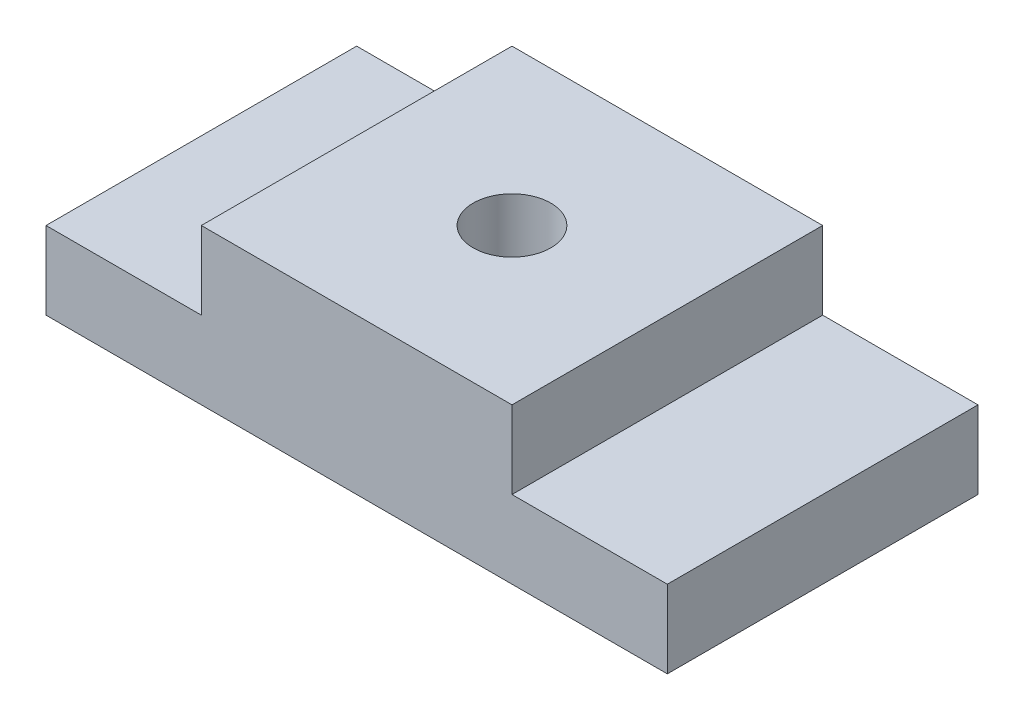
ISO-10303-21;
HEADER;
FILE_DESCRIPTION(('STEP AP214'),'2;1');
FILE_NAME('part.step','',(''),(''),'','','');
FILE_SCHEMA(('AUTOMOTIVE_DESIGN { 1 0 10303 214 1 1 1 1 }'));
ENDSEC;
DATA;
#1=APPLICATION_CONTEXT('core data for automotive mechanical design processes');
#2=APPLICATION_PROTOCOL_DEFINITION('international standard','automotive_design',2000,#1);
#3=PRODUCT_CONTEXT('',#1,'mechanical');
#4=PRODUCT('Part','Part','',(#3));
#5=PRODUCT_RELATED_PRODUCT_CATEGORY('part','',(#4));
#6=PRODUCT_DEFINITION_FORMATION('','',#4);
#7=PRODUCT_DEFINITION_CONTEXT('part definition',#1,'design');
#8=PRODUCT_DEFINITION('design','',#6,#7);
#9=PRODUCT_DEFINITION_SHAPE('','',#8);
#10=(LENGTH_UNIT() NAMED_UNIT(*) SI_UNIT(.MILLI.,.METRE.));
#11=(NAMED_UNIT(*) PLANE_ANGLE_UNIT() SI_UNIT($,.RADIAN.));
#12=(NAMED_UNIT(*) SI_UNIT($,.STERADIAN.) SOLID_ANGLE_UNIT());
#13=UNCERTAINTY_MEASURE_WITH_UNIT(LENGTH_MEASURE(1.E-05),#10,'distance_accuracy_value','');
#14=(GEOMETRIC_REPRESENTATION_CONTEXT(3) GLOBAL_UNCERTAINTY_ASSIGNED_CONTEXT((#13)) GLOBAL_UNIT_ASSIGNED_CONTEXT((#10,
#11,#12)) REPRESENTATION_CONTEXT('',''));
#15=CARTESIAN_POINT('',(0.,0.,0.));
#16=DIRECTION('',(0.,0.,1.));
#17=DIRECTION('',(1.,0.,0.));
#18=AXIS2_PLACEMENT_3D('',#15,#16,#17);
#19=CARTESIAN_POINT('',(0.,10.,0.));
#20=DIRECTION('',(0.,-1.,0.));
#21=DIRECTION('',(0.,0.,-1.));
#22=AXIS2_PLACEMENT_3D('',#19,#20,#21);
#23=PLANE('',#22);
#24=DIRECTION('',(0.,0.,-1.));
#25=VECTOR('',#24,1.);
#26=CARTESIAN_POINT('',(20.,10.,20.));
#27=LINE('',#26,#25);
#28=CARTESIAN_POINT('',(20.,10.,20.));
#29=VERTEX_POINT('',#28);
#30=CARTESIAN_POINT('',(20.,10.,-20.));
#31=VERTEX_POINT('',#30);
#32=EDGE_CURVE('E54',#29,#31,#27,.T.);
#33=ORIENTED_EDGE('',*,*,#32,.F.);
#34=DIRECTION('',(1.,0.,0.));
#35=VECTOR('',#34,1.);
#36=CARTESIAN_POINT('',(-40.,10.,20.));
#37=LINE('',#36,#35);
#38=CARTESIAN_POINT('',(40.,10.,20.));
#39=VERTEX_POINT('',#38);
#40=EDGE_CURVE('E151',#29,#39,#37,.T.);
#41=ORIENTED_EDGE('',*,*,#40,.T.);
#42=DIRECTION('',(0.,0.,-1.));
#43=VECTOR('',#42,1.);
#44=CARTESIAN_POINT('',(40.,10.,20.));
#45=LINE('',#44,#43);
#46=CARTESIAN_POINT('',(40.,10.,-20.));
#47=VERTEX_POINT('',#46);
#48=EDGE_CURVE('E139',#39,#47,#45,.T.);
#49=ORIENTED_EDGE('',*,*,#48,.T.);
#50=DIRECTION('',(-1.,0.,0.));
#51=VECTOR('',#50,1.);
#52=CARTESIAN_POINT('',(-40.,10.,-20.));
#53=LINE('',#52,#51);
#54=EDGE_CURVE('E145',#47,#31,#53,.T.);
#55=ORIENTED_EDGE('',*,*,#54,.T.);
#56=EDGE_LOOP('',(#33,#41,#49,#55));
#57=FACE_BOUND('',#56,.T.);
#58=ADVANCED_FACE('F38',(#57),#23,.F.);
#59=DIRECTION('',(0.,0.,1.));
#60=VECTOR('',#59,1.);
#61=CARTESIAN_POINT('',(-20.,10.,20.));
#62=LINE('',#61,#60);
#63=CARTESIAN_POINT('',(-20.,10.,-20.));
#64=VERTEX_POINT('',#63);
#65=CARTESIAN_POINT('',(-20.,10.,20.));
#66=VERTEX_POINT('',#65);
#67=EDGE_CURVE('E62',#64,#66,#62,.T.);
#68=ORIENTED_EDGE('',*,*,#67,.F.);
#69=CARTESIAN_POINT('',(-40.,10.,-20.));
#70=VERTEX_POINT('',#69);
#71=EDGE_CURVE('E143',#64,#70,#53,.T.);
#72=ORIENTED_EDGE('',*,*,#71,.T.);
#73=DIRECTION('',(0.,0.,1.));
#74=VECTOR('',#73,1.);
#75=CARTESIAN_POINT('',(-40.,10.,20.));
#76=LINE('',#75,#74);
#77=CARTESIAN_POINT('',(-40.,10.,20.));
#78=VERTEX_POINT('',#77);
#79=EDGE_CURVE('E148',#70,#78,#76,.T.);
#80=ORIENTED_EDGE('',*,*,#79,.T.);
#81=EDGE_CURVE('E152',#78,#66,#37,.T.);
#82=ORIENTED_EDGE('',*,*,#81,.T.);
#83=EDGE_LOOP('',(#68,#72,#80,#82));
#84=FACE_BOUND('',#83,.T.);
#85=ADVANCED_FACE('F190',(#84),#23,.F.);
#86=CARTESIAN_POINT('',(40.,10.,20.));
#87=DIRECTION('',(-1.,0.,0.));
#88=DIRECTION('',(0.,0.,1.));
#89=AXIS2_PLACEMENT_3D('',#86,#87,#88);
#90=PLANE('',#89);
#91=DIRECTION('',(0.,0.,-1.));
#92=VECTOR('',#91,1.);
#93=CARTESIAN_POINT('',(40.,0.,20.));
#94=LINE('',#93,#92);
#95=CARTESIAN_POINT('',(40.,0.,20.));
#96=VERTEX_POINT('',#95);
#97=CARTESIAN_POINT('',(40.,0.,-20.));
#98=VERTEX_POINT('',#97);
#99=EDGE_CURVE('E128',#96,#98,#94,.T.);
#100=ORIENTED_EDGE('',*,*,#99,.T.);
#101=DIRECTION('',(0.,-1.,0.));
#102=VECTOR('',#101,1.);
#103=CARTESIAN_POINT('',(40.,10.,-20.));
#104=LINE('',#103,#102);
#105=EDGE_CURVE('E11',#47,#98,#104,.T.);
#106=ORIENTED_EDGE('',*,*,#105,.F.);
#107=ORIENTED_EDGE('',*,*,#48,.F.);
#108=DIRECTION('',(0.,-1.,0.));
#109=VECTOR('',#108,1.);
#110=CARTESIAN_POINT('',(40.,10.,20.));
#111=LINE('',#110,#109);
#112=EDGE_CURVE('E154',#39,#96,#111,.T.);
#113=ORIENTED_EDGE('',*,*,#112,.T.);
#114=EDGE_LOOP('',(#100,#106,#107,#113));
#115=FACE_BOUND('',#114,.T.);
#116=ADVANCED_FACE('F40',(#115),#90,.F.);
#117=CARTESIAN_POINT('',(-40.,10.,-20.));
#118=DIRECTION('',(0.,0.,1.));
#119=DIRECTION('',(1.,0.,0.));
#120=AXIS2_PLACEMENT_3D('',#117,#118,#119);
#121=PLANE('',#120);
#122=DIRECTION('',(-1.,0.,0.));
#123=VECTOR('',#122,1.);
#124=CARTESIAN_POINT('',(-40.,0.,-20.));
#125=LINE('',#124,#123);
#126=CARTESIAN_POINT('',(-40.,0.,-20.));
#127=VERTEX_POINT('',#126);
#128=EDGE_CURVE('E133',#98,#127,#125,.T.);
#129=ORIENTED_EDGE('',*,*,#128,.T.);
#130=DIRECTION('',(0.,-1.,0.));
#131=VECTOR('',#130,1.);
#132=CARTESIAN_POINT('',(-40.,10.,-20.));
#133=LINE('',#132,#131);
#134=EDGE_CURVE('E47',#70,#127,#133,.T.);
#135=ORIENTED_EDGE('',*,*,#134,.F.);
#136=ORIENTED_EDGE('',*,*,#71,.F.);
#137=DIRECTION('',(0.,-1.,0.));
#138=VECTOR('',#137,1.);
#139=CARTESIAN_POINT('',(-20.,20.,-20.));
#140=LINE('',#139,#138);
#141=CARTESIAN_POINT('',(-20.,20.,-20.));
#142=VERTEX_POINT('',#141);
#143=EDGE_CURVE('E110',#142,#64,#140,.T.);
#144=ORIENTED_EDGE('',*,*,#143,.F.);
#145=DIRECTION('',(-1.,0.,0.));
#146=VECTOR('',#145,1.);
#147=CARTESIAN_POINT('',(-20.,20.,-20.));
#148=LINE('',#147,#146);
#149=CARTESIAN_POINT('',(20.,20.,-20.));
#150=VERTEX_POINT('',#149);
#151=EDGE_CURVE('E104',#150,#142,#148,.T.);
#152=ORIENTED_EDGE('',*,*,#151,.F.);
#153=DIRECTION('',(0.,-1.,0.));
#154=VECTOR('',#153,1.);
#155=CARTESIAN_POINT('',(20.,20.,-20.));
#156=LINE('',#155,#154);
#157=EDGE_CURVE('E108',#150,#31,#156,.T.);
#158=ORIENTED_EDGE('',*,*,#157,.T.);
#159=ORIENTED_EDGE('',*,*,#54,.F.);
#160=ORIENTED_EDGE('',*,*,#105,.T.);
#161=EDGE_LOOP('',(#129,#135,#136,#144,#152,#158,#159,#160));
#162=FACE_BOUND('',#161,.T.);
#163=ADVANCED_FACE('F106',(#162),#121,.F.);
#164=CARTESIAN_POINT('',(-40.,10.,20.));
#165=DIRECTION('',(1.,0.,0.));
#166=DIRECTION('',(0.,0.,-1.));
#167=AXIS2_PLACEMENT_3D('',#164,#165,#166);
#168=PLANE('',#167);
#169=DIRECTION('',(0.,0.,1.));
#170=VECTOR('',#169,1.);
#171=CARTESIAN_POINT('',(-40.,0.,20.));
#172=LINE('',#171,#170);
#173=CARTESIAN_POINT('',(-40.,0.,20.));
#174=VERTEX_POINT('',#173);
#175=EDGE_CURVE('E158',#127,#174,#172,.T.);
#176=ORIENTED_EDGE('',*,*,#175,.T.);
#177=DIRECTION('',(0.,-1.,0.));
#178=VECTOR('',#177,1.);
#179=CARTESIAN_POINT('',(-40.,10.,20.));
#180=LINE('',#179,#178);
#181=EDGE_CURVE('E166',#78,#174,#180,.T.);
#182=ORIENTED_EDGE('',*,*,#181,.F.);
#183=ORIENTED_EDGE('',*,*,#79,.F.);
#184=ORIENTED_EDGE('',*,*,#134,.T.);
#185=EDGE_LOOP('',(#176,#182,#183,#184));
#186=FACE_BOUND('',#185,.T.);
#187=ADVANCED_FACE('F175',(#186),#168,.F.);
#188=CARTESIAN_POINT('',(-40.,10.,20.));
#189=DIRECTION('',(0.,0.,-1.));
#190=DIRECTION('',(-1.,0.,0.));
#191=AXIS2_PLACEMENT_3D('',#188,#189,#190);
#192=PLANE('',#191);
#193=DIRECTION('',(1.,0.,0.));
#194=VECTOR('',#193,1.);
#195=CARTESIAN_POINT('',(-40.,0.,20.));
#196=LINE('',#195,#194);
#197=EDGE_CURVE('E144',#174,#96,#196,.T.);
#198=ORIENTED_EDGE('',*,*,#197,.T.);
#199=ORIENTED_EDGE('',*,*,#112,.F.);
#200=ORIENTED_EDGE('',*,*,#40,.F.);
#201=DIRECTION('',(0.,-1.,0.));
#202=VECTOR('',#201,1.);
#203=CARTESIAN_POINT('',(20.,20.,20.));
#204=LINE('',#203,#202);
#205=CARTESIAN_POINT('',(20.,20.,20.));
#206=VERTEX_POINT('',#205);
#207=EDGE_CURVE('E198',#206,#29,#204,.T.);
#208=ORIENTED_EDGE('',*,*,#207,.F.);
#209=DIRECTION('',(1.,0.,0.));
#210=VECTOR('',#209,1.);
#211=CARTESIAN_POINT('',(-20.,20.,20.));
#212=LINE('',#211,#210);
#213=CARTESIAN_POINT('',(-20.,20.,20.));
#214=VERTEX_POINT('',#213);
#215=EDGE_CURVE('E120',#214,#206,#212,.T.);
#216=ORIENTED_EDGE('',*,*,#215,.F.);
#217=DIRECTION('',(0.,-1.,0.));
#218=VECTOR('',#217,1.);
#219=CARTESIAN_POINT('',(-20.,20.,20.));
#220=LINE('',#219,#218);
#221=EDGE_CURVE('E135',#214,#66,#220,.T.);
#222=ORIENTED_EDGE('',*,*,#221,.T.);
#223=ORIENTED_EDGE('',*,*,#81,.F.);
#224=ORIENTED_EDGE('',*,*,#181,.T.);
#225=EDGE_LOOP('',(#198,#199,#200,#208,#216,#222,#223,#224));
#226=FACE_BOUND('',#225,.T.);
#227=ADVANCED_FACE('F183',(#226),#192,.F.);
#228=CARTESIAN_POINT('',(0.,0.,0.));
#229=DIRECTION('',(0.,-1.,0.));
#230=DIRECTION('',(0.,0.,-1.));
#231=AXIS2_PLACEMENT_3D('',#228,#229,#230);
#232=PLANE('',#231);
#233=ORIENTED_EDGE('',*,*,#99,.F.);
#234=ORIENTED_EDGE('',*,*,#197,.F.);
#235=ORIENTED_EDGE('',*,*,#175,.F.);
#236=ORIENTED_EDGE('',*,*,#128,.F.);
#237=EDGE_LOOP('',(#233,#234,#235,#236));
#238=FACE_BOUND('',#237,.T.);
#239=ADVANCED_FACE('F180',(#238),#232,.T.);
#240=CARTESIAN_POINT('',(20.,20.,20.));
#241=DIRECTION('',(-1.,0.,0.));
#242=DIRECTION('',(0.,0.,1.));
#243=AXIS2_PLACEMENT_3D('',#240,#241,#242);
#244=PLANE('',#243);
#245=ORIENTED_EDGE('',*,*,#32,.T.);
#246=ORIENTED_EDGE('',*,*,#157,.F.);
#247=DIRECTION('',(0.,0.,-1.));
#248=VECTOR('',#247,1.);
#249=CARTESIAN_POINT('',(20.,20.,20.));
#250=LINE('',#249,#248);
#251=EDGE_CURVE('E115',#206,#150,#250,.T.);
#252=ORIENTED_EDGE('',*,*,#251,.F.);
#253=ORIENTED_EDGE('',*,*,#207,.T.);
#254=EDGE_LOOP('',(#245,#246,#252,#253));
#255=FACE_BOUND('',#254,.T.);
#256=ADVANCED_FACE('F126',(#255),#244,.F.);
#257=CARTESIAN_POINT('',(-20.,20.,20.));
#258=DIRECTION('',(1.,0.,0.));
#259=DIRECTION('',(0.,0.,-1.));
#260=AXIS2_PLACEMENT_3D('',#257,#258,#259);
#261=PLANE('',#260);
#262=ORIENTED_EDGE('',*,*,#67,.T.);
#263=ORIENTED_EDGE('',*,*,#221,.F.);
#264=DIRECTION('',(0.,0.,1.));
#265=VECTOR('',#264,1.);
#266=CARTESIAN_POINT('',(-20.,20.,20.));
#267=LINE('',#266,#265);
#268=EDGE_CURVE('E114',#142,#214,#267,.T.);
#269=ORIENTED_EDGE('',*,*,#268,.F.);
#270=ORIENTED_EDGE('',*,*,#143,.T.);
#271=EDGE_LOOP('',(#262,#263,#269,#270));
#272=FACE_BOUND('',#271,.T.);
#273=ADVANCED_FACE('F192',(#272),#261,.F.);
#274=CARTESIAN_POINT('',(0.,20.,0.));
#275=DIRECTION('',(0.,-1.,0.));
#276=DIRECTION('',(0.,0.,-1.));
#277=AXIS2_PLACEMENT_3D('',#274,#275,#276);
#278=PLANE('',#277);
#279=CARTESIAN_POINT('',(0.,20.,0.));
#280=DIRECTION('',(0.,1.,0.));
#281=DIRECTION('',(0.,0.,1.));
#282=AXIS2_PLACEMENT_3D('',#279,#280,#281);
#283=CIRCLE('',#282,5.);
#284=CARTESIAN_POINT('',(0.,20.,5.));
#285=VERTEX_POINT('',#284);
#286=EDGE_CURVE('E211',#285,#285,#283,.T.);
#287=ORIENTED_EDGE('',*,*,#286,.F.);
#288=EDGE_LOOP('',(#287));
#289=FACE_BOUND('',#288,.T.);
#290=ORIENTED_EDGE('',*,*,#251,.T.);
#291=ORIENTED_EDGE('',*,*,#151,.T.);
#292=ORIENTED_EDGE('',*,*,#268,.T.);
#293=ORIENTED_EDGE('',*,*,#215,.T.);
#294=EDGE_LOOP('',(#290,#291,#292,#293));
#295=FACE_BOUND('',#294,.T.);
#296=ADVANCED_FACE('F118',(#289,#295),#278,.F.);
#297=CARTESIAN_POINT('',(0.,10.,0.));
#298=DIRECTION('',(0.,1.,0.));
#299=DIRECTION('',(0.,0.,1.));
#300=AXIS2_PLACEMENT_3D('',#297,#298,#299);
#301=CYLINDRICAL_SURFACE('',#300,5.);
#302=CARTESIAN_POINT('',(0.,10.,0.));
#303=DIRECTION('',(0.,1.,0.));
#304=DIRECTION('',(0.,0.,1.));
#305=AXIS2_PLACEMENT_3D('',#302,#303,#304);
#306=CIRCLE('',#305,5.);
#307=CARTESIAN_POINT('',(0.,10.,5.));
#308=VERTEX_POINT('',#307);
#309=EDGE_CURVE('E203',#308,#308,#306,.T.);
#310=ORIENTED_EDGE('',*,*,#309,.F.);
#311=EDGE_LOOP('',(#310));
#312=FACE_BOUND('',#311,.T.);
#313=ORIENTED_EDGE('',*,*,#286,.T.);
#314=EDGE_LOOP('',(#313));
#315=FACE_BOUND('',#314,.T.);
#316=ADVANCED_FACE('F217',(#312,#315),#301,.F.);
#317=CARTESIAN_POINT('',(0.,10.,0.));
#318=DIRECTION('',(0.,1.,0.));
#319=DIRECTION('',(0.,0.,1.));
#320=AXIS2_PLACEMENT_3D('',#317,#318,#319);
#321=PLANE('',#320);
#322=ORIENTED_EDGE('',*,*,#309,.T.);
#323=EDGE_LOOP('',(#322));
#324=FACE_BOUND('',#323,.T.);
#325=ADVANCED_FACE('F226',(#324),#321,.T.);
#326=CLOSED_SHELL('',(#58,#85,#116,#163,#187,#227,#239,#256,#273,#296,#316,#325));
#327=MANIFOLD_SOLID_BREP('B2',#326);
#328=ADVANCED_BREP_SHAPE_REPRESENTATION('',(#18,#327),#14);
#329=SHAPE_DEFINITION_REPRESENTATION(#9,#328);
ENDSEC;
END-ISO-10303-21;
